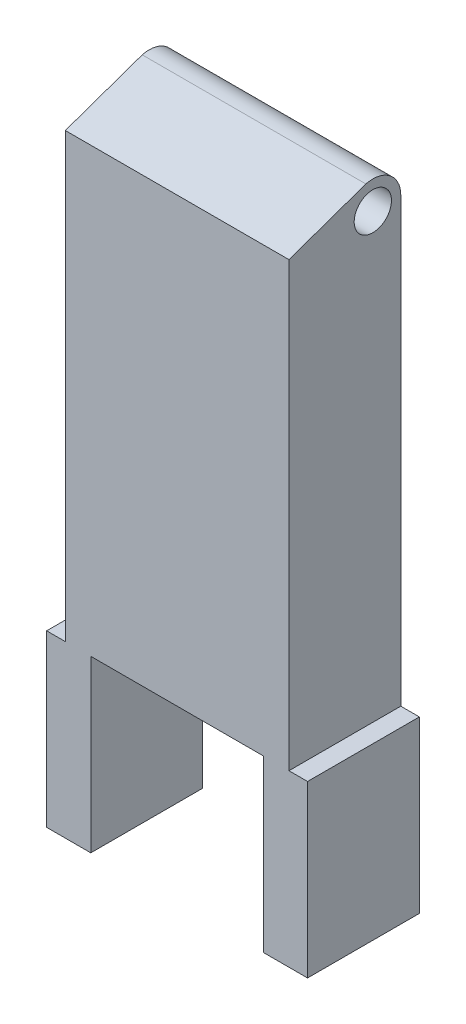
ISO-10303-21;
HEADER;
FILE_DESCRIPTION(('STEP AP214'),'2;1');
FILE_NAME('part.step','',(''),(''),'','','');
FILE_SCHEMA(('AUTOMOTIVE_DESIGN { 1 0 10303 214 1 1 1 1 }'));
ENDSEC;
DATA;
#1=APPLICATION_CONTEXT('core data for automotive mechanical design processes');
#2=APPLICATION_PROTOCOL_DEFINITION('international standard','automotive_design',2000,#1);
#3=PRODUCT_CONTEXT('',#1,'mechanical');
#4=PRODUCT('Part','Part','',(#3));
#5=PRODUCT_RELATED_PRODUCT_CATEGORY('part','',(#4));
#6=PRODUCT_DEFINITION_FORMATION('','',#4);
#7=PRODUCT_DEFINITION_CONTEXT('part definition',#1,'design');
#8=PRODUCT_DEFINITION('design','',#6,#7);
#9=PRODUCT_DEFINITION_SHAPE('','',#8);
#10=(LENGTH_UNIT() NAMED_UNIT(*) SI_UNIT(.MILLI.,.METRE.));
#11=(NAMED_UNIT(*) PLANE_ANGLE_UNIT() SI_UNIT($,.RADIAN.));
#12=(NAMED_UNIT(*) SI_UNIT($,.STERADIAN.) SOLID_ANGLE_UNIT());
#13=UNCERTAINTY_MEASURE_WITH_UNIT(LENGTH_MEASURE(1.E-05),#10,'distance_accuracy_value','');
#14=(GEOMETRIC_REPRESENTATION_CONTEXT(3) GLOBAL_UNCERTAINTY_ASSIGNED_CONTEXT((#13)) GLOBAL_UNIT_ASSIGNED_CONTEXT((#10,
#11,#12)) REPRESENTATION_CONTEXT('',''));
#15=CARTESIAN_POINT('',(0.,0.,0.));
#16=DIRECTION('',(0.,0.,1.));
#17=DIRECTION('',(1.,0.,0.));
#18=AXIS2_PLACEMENT_3D('',#15,#16,#17);
#19=CARTESIAN_POINT('',(-11.9943953349325,44.7749698089172,12.));
#20=DIRECTION('',(1.,0.,0.));
#21=DIRECTION('',(0.,1.,0.));
#22=AXIS2_PLACEMENT_3D('',#19,#20,#21);
#23=PLANE('',#22);
#24=CARTESIAN_POINT('',(-11.9943953349325,44.7749698089172,3.));
#25=DIRECTION('',(1.,0.,0.));
#26=DIRECTION('',(0.,1.,0.));
#27=AXIS2_PLACEMENT_3D('',#24,#25,#26);
#28=CIRCLE('',#27,2.);
#29=CARTESIAN_POINT('',(-11.9943953349325,46.7749698089172,3.));
#30=VERTEX_POINT('',#29);
#31=EDGE_CURVE('E251',#30,#30,#28,.T.);
#32=ORIENTED_EDGE('',*,*,#31,.T.);
#33=EDGE_LOOP('',(#32));
#34=FACE_BOUND('',#33,.T.);
#35=DIRECTION('',(0.,-1.,0.));
#36=VECTOR('',#35,1.);
#37=CARTESIAN_POINT('',(-11.9943953349325,44.7749698089172,0.));
#38=LINE('',#37,#36);
#39=CARTESIAN_POINT('',(-11.9943953349325,44.7749698089172,0.));
#40=VERTEX_POINT('',#39);
#41=CARTESIAN_POINT('',(-11.9943953349325,-2.72503019108281,0.));
#42=VERTEX_POINT('',#41);
#43=EDGE_CURVE('E158',#40,#42,#38,.T.);
#44=ORIENTED_EDGE('',*,*,#43,.T.);
#45=DIRECTION('',(0.,0.,-1.));
#46=VECTOR('',#45,1.);
#47=CARTESIAN_POINT('',(-11.9943953349325,-2.72503019108281,12.));
#48=LINE('',#47,#46);
#49=CARTESIAN_POINT('',(-11.9943953349325,-2.72503019108281,12.));
#50=VERTEX_POINT('',#49);
#51=EDGE_CURVE('E11',#50,#42,#48,.T.);
#52=ORIENTED_EDGE('',*,*,#51,.F.);
#53=DIRECTION('',(0.,-1.,0.));
#54=VECTOR('',#53,1.);
#55=CARTESIAN_POINT('',(-11.9943953349325,44.7749698089172,12.));
#56=LINE('',#55,#54);
#57=CARTESIAN_POINT('',(-11.9943953349325,44.7749698089172,12.));
#58=VERTEX_POINT('',#57);
#59=EDGE_CURVE('E104',#58,#50,#56,.T.);
#60=ORIENTED_EDGE('',*,*,#59,.F.);
#61=DIRECTION('',(0.,-0.332073704616126,0.943253441394476));
#62=VECTOR('',#61,1.);
#63=CARTESIAN_POINT('',(-11.9943953349325,44.7749698089172,12.));
#64=LINE('',#63,#62);
#65=CARTESIAN_POINT('',(-11.9943953349325,47.6805618627776,3.74668254067112));
#66=VERTEX_POINT('',#65);
#67=EDGE_CURVE('E259',#66,#58,#64,.T.);
#68=ORIENTED_EDGE('',*,*,#67,.F.);
#69=CARTESIAN_POINT('',(-11.9943953349325,44.7749698089172,3.));
#70=DIRECTION('',(1.,0.,0.));
#71=DIRECTION('',(0.,1.,0.));
#72=AXIS2_PLACEMENT_3D('',#69,#70,#71);
#73=CIRCLE('',#72,3.);
#74=EDGE_CURVE('E253',#40,#66,#73,.T.);
#75=ORIENTED_EDGE('',*,*,#74,.F.);
#76=EDGE_LOOP('',(#44,#52,#60,#68,#75));
#77=FACE_BOUND('',#76,.T.);
#78=ADVANCED_FACE('F33',(#34,#77),#23,.F.);
#79=CARTESIAN_POINT('',(-11.9943953349325,-2.72503019108281,12.));
#80=DIRECTION('',(0.,-1.,0.));
#81=DIRECTION('',(0.,0.,-1.));
#82=AXIS2_PLACEMENT_3D('',#79,#80,#81);
#83=PLANE('',#82);
#84=DIRECTION('',(-1.,0.,0.));
#85=VECTOR('',#84,1.);
#86=CARTESIAN_POINT('',(-11.9943953349325,-2.72503019108281,0.));
#87=LINE('',#86,#85);
#88=CARTESIAN_POINT('',(-13.9997950624707,-2.72503019108281,0.));
#89=VERTEX_POINT('',#88);
#90=EDGE_CURVE('E161',#42,#89,#87,.T.);
#91=ORIENTED_EDGE('',*,*,#90,.T.);
#92=DIRECTION('',(0.,0.,-1.));
#93=VECTOR('',#92,1.);
#94=CARTESIAN_POINT('',(-13.9997950624707,-2.72503019108281,12.));
#95=LINE('',#94,#93);
#96=CARTESIAN_POINT('',(-13.9997950624707,-2.72503019108281,12.));
#97=VERTEX_POINT('',#96);
#98=EDGE_CURVE('E41',#97,#89,#95,.T.);
#99=ORIENTED_EDGE('',*,*,#98,.F.);
#100=DIRECTION('',(-1.,0.,0.));
#101=VECTOR('',#100,1.);
#102=CARTESIAN_POINT('',(-11.9943953349325,-2.72503019108281,12.));
#103=LINE('',#102,#101);
#104=EDGE_CURVE('E265',#50,#97,#103,.T.);
#105=ORIENTED_EDGE('',*,*,#104,.F.);
#106=ORIENTED_EDGE('',*,*,#51,.T.);
#107=EDGE_LOOP('',(#91,#99,#105,#106));
#108=FACE_BOUND('',#107,.T.);
#109=ADVANCED_FACE('F266',(#108),#83,.F.);
#110=CARTESIAN_POINT('',(-13.9997950624707,-20.9931901910828,12.));
#111=DIRECTION('',(1.,0.,0.));
#112=DIRECTION('',(0.,0.,-1.));
#113=AXIS2_PLACEMENT_3D('',#110,#111,#112);
#114=PLANE('',#113);
#115=DIRECTION('',(0.,-1.,0.));
#116=VECTOR('',#115,1.);
#117=CARTESIAN_POINT('',(-13.9997950624707,-20.9931901910828,0.));
#118=LINE('',#117,#116);
#119=CARTESIAN_POINT('',(-13.9997950624707,-20.9931901910828,0.));
#120=VERTEX_POINT('',#119);
#121=EDGE_CURVE('E163',#89,#120,#118,.T.);
#122=ORIENTED_EDGE('',*,*,#121,.T.);
#123=DIRECTION('',(0.,0.,-1.));
#124=VECTOR('',#123,1.);
#125=CARTESIAN_POINT('',(-13.9997950624707,-20.9931901910828,12.));
#126=LINE('',#125,#124);
#127=CARTESIAN_POINT('',(-13.9997950624707,-20.9931901910828,12.));
#128=VERTEX_POINT('',#127);
#129=EDGE_CURVE('E193',#128,#120,#126,.T.);
#130=ORIENTED_EDGE('',*,*,#129,.F.);
#131=DIRECTION('',(0.,-1.,0.));
#132=VECTOR('',#131,1.);
#133=CARTESIAN_POINT('',(-13.9997950624707,-20.9931901910828,12.));
#134=LINE('',#133,#132);
#135=EDGE_CURVE('E202',#97,#128,#134,.T.);
#136=ORIENTED_EDGE('',*,*,#135,.F.);
#137=ORIENTED_EDGE('',*,*,#98,.T.);
#138=EDGE_LOOP('',(#122,#130,#136,#137));
#139=FACE_BOUND('',#138,.T.);
#140=ADVANCED_FACE('F200',(#139),#114,.F.);
#141=CARTESIAN_POINT('',(-9.26108431245108,-20.9931901910828,12.));
#142=DIRECTION('',(0.,1.,0.));
#143=DIRECTION('',(0.,0.,1.));
#144=AXIS2_PLACEMENT_3D('',#141,#142,#143);
#145=PLANE('',#144);
#146=DIRECTION('',(1.,0.,0.));
#147=VECTOR('',#146,1.);
#148=CARTESIAN_POINT('',(-9.26108431245108,-20.9931901910828,0.));
#149=LINE('',#148,#147);
#150=CARTESIAN_POINT('',(-9.26108431245108,-20.9931901910828,0.));
#151=VERTEX_POINT('',#150);
#152=EDGE_CURVE('E165',#120,#151,#149,.T.);
#153=ORIENTED_EDGE('',*,*,#152,.T.);
#154=DIRECTION('',(0.,0.,-1.));
#155=VECTOR('',#154,1.);
#156=CARTESIAN_POINT('',(-9.26108431245108,-20.9931901910828,12.));
#157=LINE('',#156,#155);
#158=CARTESIAN_POINT('',(-9.26108431245108,-20.9931901910828,12.));
#159=VERTEX_POINT('',#158);
#160=EDGE_CURVE('E190',#159,#151,#157,.T.);
#161=ORIENTED_EDGE('',*,*,#160,.F.);
#162=DIRECTION('',(1.,0.,0.));
#163=VECTOR('',#162,1.);
#164=CARTESIAN_POINT('',(-9.26108431245108,-20.9931901910828,12.));
#165=LINE('',#164,#163);
#166=EDGE_CURVE('E223',#128,#159,#165,.T.);
#167=ORIENTED_EDGE('',*,*,#166,.F.);
#168=ORIENTED_EDGE('',*,*,#129,.T.);
#169=EDGE_LOOP('',(#153,#161,#167,#168));
#170=FACE_BOUND('',#169,.T.);
#171=ADVANCED_FACE('F214',(#170),#145,.F.);
#172=CARTESIAN_POINT('',(-9.26108431245108,-20.9931901910828,12.));
#173=DIRECTION('',(-1.,0.,0.));
#174=DIRECTION('',(0.,0.,1.));
#175=AXIS2_PLACEMENT_3D('',#172,#173,#174);
#176=PLANE('',#175);
#177=DIRECTION('',(0.,1.,0.));
#178=VECTOR('',#177,1.);
#179=CARTESIAN_POINT('',(-9.26108431245108,-20.9931901910828,0.));
#180=LINE('',#179,#178);
#181=CARTESIAN_POINT('',(-9.26108431245108,-2.72503019108281,0.));
#182=VERTEX_POINT('',#181);
#183=EDGE_CURVE('E167',#151,#182,#180,.T.);
#184=ORIENTED_EDGE('',*,*,#183,.T.);
#185=DIRECTION('',(0.,0.,-1.));
#186=VECTOR('',#185,1.);
#187=CARTESIAN_POINT('',(-9.26108431245108,-2.72503019108281,12.));
#188=LINE('',#187,#186);
#189=CARTESIAN_POINT('',(-9.26108431245108,-2.72503019108281,12.));
#190=VERTEX_POINT('',#189);
#191=EDGE_CURVE('E187',#190,#182,#188,.T.);
#192=ORIENTED_EDGE('',*,*,#191,.F.);
#193=DIRECTION('',(0.,1.,0.));
#194=VECTOR('',#193,1.);
#195=CARTESIAN_POINT('',(-9.26108431245108,-20.9931901910828,12.));
#196=LINE('',#195,#194);
#197=EDGE_CURVE('E220',#159,#190,#196,.T.);
#198=ORIENTED_EDGE('',*,*,#197,.F.);
#199=ORIENTED_EDGE('',*,*,#160,.T.);
#200=EDGE_LOOP('',(#184,#192,#198,#199));
#201=FACE_BOUND('',#200,.T.);
#202=ADVANCED_FACE('F218',(#201),#176,.F.);
#203=CARTESIAN_POINT('',(9.26149418750964,-2.72708825757931,12.));
#204=DIRECTION('',(0.000111111230210319,0.999999993827147,0.));
#205=DIRECTION('',(-0.999999993827147,0.000111111230210319,0.));
#206=AXIS2_PLACEMENT_3D('',#203,#204,#205);
#207=PLANE('',#206);
#208=DIRECTION('',(0.999999993827147,-0.000111111230210319,0.));
#209=VECTOR('',#208,1.);
#210=CARTESIAN_POINT('',(9.26149418750964,-2.72708825757931,0.));
#211=LINE('',#210,#209);
#212=CARTESIAN_POINT('',(9.26149418750964,-2.72708825757931,0.));
#213=VERTEX_POINT('',#212);
#214=EDGE_CURVE('E169',#182,#213,#211,.T.);
#215=ORIENTED_EDGE('',*,*,#214,.T.);
#216=DIRECTION('',(0.,0.,-1.));
#217=VECTOR('',#216,1.);
#218=CARTESIAN_POINT('',(9.26149418750964,-2.72708825757931,12.));
#219=LINE('',#218,#217);
#220=CARTESIAN_POINT('',(9.26149418750964,-2.72708825757931,12.));
#221=VERTEX_POINT('',#220);
#222=EDGE_CURVE('E184',#221,#213,#219,.T.);
#223=ORIENTED_EDGE('',*,*,#222,.F.);
#224=DIRECTION('',(0.999999993827147,-0.000111111230210319,0.));
#225=VECTOR('',#224,1.);
#226=CARTESIAN_POINT('',(9.26149418750964,-2.72708825757931,12.));
#227=LINE('',#226,#225);
#228=EDGE_CURVE('E222',#190,#221,#227,.T.);
#229=ORIENTED_EDGE('',*,*,#228,.F.);
#230=ORIENTED_EDGE('',*,*,#191,.T.);
#231=EDGE_LOOP('',(#215,#223,#229,#230));
#232=FACE_BOUND('',#231,.T.);
#233=ADVANCED_FACE('F370',(#232),#207,.F.);
#234=CARTESIAN_POINT('',(9.26149418750964,-20.9931901910828,12.));
#235=DIRECTION('',(1.,0.,0.));
#236=DIRECTION('',(0.,0.,-1.));
#237=AXIS2_PLACEMENT_3D('',#234,#235,#236);
#238=PLANE('',#237);
#239=DIRECTION('',(0.,-1.,0.));
#240=VECTOR('',#239,1.);
#241=CARTESIAN_POINT('',(9.26149418750964,-20.9931901910828,0.));
#242=LINE('',#241,#240);
#243=CARTESIAN_POINT('',(9.26149418750964,-20.9931901910828,0.));
#244=VERTEX_POINT('',#243);
#245=EDGE_CURVE('E171',#213,#244,#242,.T.);
#246=ORIENTED_EDGE('',*,*,#245,.T.);
#247=DIRECTION('',(0.,0.,-1.));
#248=VECTOR('',#247,1.);
#249=CARTESIAN_POINT('',(9.26149418750964,-20.9931901910828,12.));
#250=LINE('',#249,#248);
#251=CARTESIAN_POINT('',(9.26149418750964,-20.9931901910828,12.));
#252=VERTEX_POINT('',#251);
#253=EDGE_CURVE('E181',#252,#244,#250,.T.);
#254=ORIENTED_EDGE('',*,*,#253,.F.);
#255=DIRECTION('',(0.,-1.,0.));
#256=VECTOR('',#255,1.);
#257=CARTESIAN_POINT('',(9.26149418750964,-20.9931901910828,12.));
#258=LINE('',#257,#256);
#259=EDGE_CURVE('E225',#221,#252,#258,.T.);
#260=ORIENTED_EDGE('',*,*,#259,.F.);
#261=ORIENTED_EDGE('',*,*,#222,.T.);
#262=EDGE_LOOP('',(#246,#254,#260,#261));
#263=FACE_BOUND('',#262,.T.);
#264=ADVANCED_FACE('F234',(#263),#238,.F.);
#265=CARTESIAN_POINT('',(9.26149418750964,-20.9931901910828,12.));
#266=DIRECTION('',(0.,1.,0.));
#267=DIRECTION('',(0.,0.,1.));
#268=AXIS2_PLACEMENT_3D('',#265,#266,#267);
#269=PLANE('',#268);
#270=DIRECTION('',(1.,0.,0.));
#271=VECTOR('',#270,1.);
#272=CARTESIAN_POINT('',(9.26149418750964,-20.9931901910828,0.));
#273=LINE('',#272,#271);
#274=CARTESIAN_POINT('',(14.0002049375293,-20.9931901910828,0.));
#275=VERTEX_POINT('',#274);
#276=EDGE_CURVE('E173',#244,#275,#273,.T.);
#277=ORIENTED_EDGE('',*,*,#276,.T.);
#278=DIRECTION('',(0.,0.,-1.));
#279=VECTOR('',#278,1.);
#280=CARTESIAN_POINT('',(14.0002049375293,-20.9931901910828,12.));
#281=LINE('',#280,#279);
#282=CARTESIAN_POINT('',(14.0002049375293,-20.9931901910828,12.));
#283=VERTEX_POINT('',#282);
#284=EDGE_CURVE('E147',#283,#275,#281,.T.);
#285=ORIENTED_EDGE('',*,*,#284,.F.);
#286=DIRECTION('',(1.,0.,0.));
#287=VECTOR('',#286,1.);
#288=CARTESIAN_POINT('',(9.26149418750964,-20.9931901910828,12.));
#289=LINE('',#288,#287);
#290=EDGE_CURVE('E138',#252,#283,#289,.T.);
#291=ORIENTED_EDGE('',*,*,#290,.F.);
#292=ORIENTED_EDGE('',*,*,#253,.T.);
#293=EDGE_LOOP('',(#277,#285,#291,#292));
#294=FACE_BOUND('',#293,.T.);
#295=ADVANCED_FACE('F238',(#294),#269,.F.);
#296=CARTESIAN_POINT('',(14.0002049375293,-20.9931901910828,12.));
#297=DIRECTION('',(-1.,0.,0.));
#298=DIRECTION('',(0.,0.,1.));
#299=AXIS2_PLACEMENT_3D('',#296,#297,#298);
#300=PLANE('',#299);
#301=DIRECTION('',(0.,1.,0.));
#302=VECTOR('',#301,1.);
#303=CARTESIAN_POINT('',(14.0002049375293,-20.9931901910828,0.));
#304=LINE('',#303,#302);
#305=CARTESIAN_POINT('',(14.0002049375293,-2.72708825757931,0.));
#306=VERTEX_POINT('',#305);
#307=EDGE_CURVE('E146',#275,#306,#304,.T.);
#308=ORIENTED_EDGE('',*,*,#307,.T.);
#309=DIRECTION('',(0.,0.,-1.));
#310=VECTOR('',#309,1.);
#311=CARTESIAN_POINT('',(14.0002049375293,-2.72708825757931,12.));
#312=LINE('',#311,#310);
#313=CARTESIAN_POINT('',(14.0002049375293,-2.72708825757931,12.));
#314=VERTEX_POINT('',#313);
#315=EDGE_CURVE('E143',#314,#306,#312,.T.);
#316=ORIENTED_EDGE('',*,*,#315,.F.);
#317=DIRECTION('',(0.,1.,0.));
#318=VECTOR('',#317,1.);
#319=CARTESIAN_POINT('',(14.0002049375293,-20.9931901910828,12.));
#320=LINE('',#319,#318);
#321=EDGE_CURVE('E132',#283,#314,#320,.T.);
#322=ORIENTED_EDGE('',*,*,#321,.F.);
#323=ORIENTED_EDGE('',*,*,#284,.T.);
#324=EDGE_LOOP('',(#308,#316,#322,#323));
#325=FACE_BOUND('',#324,.T.);
#326=ADVANCED_FACE('F144',(#325),#300,.F.);
#327=CARTESIAN_POINT('',(14.0002049375293,-2.72708825757931,12.));
#328=DIRECTION('',(0.,-1.,0.));
#329=DIRECTION('',(0.,0.,-1.));
#330=AXIS2_PLACEMENT_3D('',#327,#328,#329);
#331=PLANE('',#330);
#332=DIRECTION('',(-1.,0.,0.));
#333=VECTOR('',#332,1.);
#334=CARTESIAN_POINT('',(14.0002049375293,-2.72708825757931,0.));
#335=LINE('',#334,#333);
#336=CARTESIAN_POINT('',(12.0056046650675,-2.72708825757931,0.));
#337=VERTEX_POINT('',#336);
#338=EDGE_CURVE('E88',#306,#337,#335,.T.);
#339=ORIENTED_EDGE('',*,*,#338,.T.);
#340=DIRECTION('',(0.,0.,-1.));
#341=VECTOR('',#340,1.);
#342=CARTESIAN_POINT('',(12.0056046650675,-2.72708825757931,12.));
#343=LINE('',#342,#341);
#344=CARTESIAN_POINT('',(12.0056046650675,-2.72708825757931,12.));
#345=VERTEX_POINT('',#344);
#346=EDGE_CURVE('E148',#345,#337,#343,.T.);
#347=ORIENTED_EDGE('',*,*,#346,.F.);
#348=DIRECTION('',(-1.,0.,0.));
#349=VECTOR('',#348,1.);
#350=CARTESIAN_POINT('',(14.0002049375293,-2.72708825757931,12.));
#351=LINE('',#350,#349);
#352=EDGE_CURVE('E136',#314,#345,#351,.T.);
#353=ORIENTED_EDGE('',*,*,#352,.F.);
#354=ORIENTED_EDGE('',*,*,#315,.T.);
#355=EDGE_LOOP('',(#339,#347,#353,#354));
#356=FACE_BOUND('',#355,.T.);
#357=ADVANCED_FACE('F150',(#356),#331,.F.);
#358=CARTESIAN_POINT('',(12.0056046650675,44.7749698089172,12.));
#359=DIRECTION('',(-1.,0.,0.));
#360=DIRECTION('',(0.,-1.,0.));
#361=AXIS2_PLACEMENT_3D('',#358,#359,#360);
#362=PLANE('',#361);
#363=CARTESIAN_POINT('',(12.0056046650675,44.7749698089172,3.));
#364=DIRECTION('',(1.,0.,0.));
#365=DIRECTION('',(0.,1.,0.));
#366=AXIS2_PLACEMENT_3D('',#363,#364,#365);
#367=CIRCLE('',#366,2.);
#368=CARTESIAN_POINT('',(12.0056046650675,46.7749698089172,3.));
#369=VERTEX_POINT('',#368);
#370=EDGE_CURVE('E256',#369,#369,#367,.T.);
#371=ORIENTED_EDGE('',*,*,#370,.F.);
#372=EDGE_LOOP('',(#371));
#373=FACE_BOUND('',#372,.T.);
#374=DIRECTION('',(0.,1.,0.));
#375=VECTOR('',#374,1.);
#376=CARTESIAN_POINT('',(12.0056046650675,44.7749698089172,0.));
#377=LINE('',#376,#375);
#378=CARTESIAN_POINT('',(12.0056046650675,44.7749698089172,0.));
#379=VERTEX_POINT('',#378);
#380=EDGE_CURVE('E95',#337,#379,#377,.T.);
#381=ORIENTED_EDGE('',*,*,#380,.T.);
#382=CARTESIAN_POINT('',(12.0056046650675,44.7749698089172,3.));
#383=DIRECTION('',(1.,0.,0.));
#384=DIRECTION('',(0.,1.,0.));
#385=AXIS2_PLACEMENT_3D('',#382,#383,#384);
#386=CIRCLE('',#385,3.);
#387=CARTESIAN_POINT('',(12.0056046650675,47.6805618627776,3.74668254067112));
#388=VERTEX_POINT('',#387);
#389=EDGE_CURVE('E245',#379,#388,#386,.T.);
#390=ORIENTED_EDGE('',*,*,#389,.T.);
#391=DIRECTION('',(0.,-0.332073704616126,0.943253441394476));
#392=VECTOR('',#391,1.);
#393=CARTESIAN_POINT('',(12.0056046650675,44.7749698089172,12.));
#394=LINE('',#393,#392);
#395=CARTESIAN_POINT('',(12.0056046650675,44.7749698089172,12.));
#396=VERTEX_POINT('',#395);
#397=EDGE_CURVE('E250',#388,#396,#394,.T.);
#398=ORIENTED_EDGE('',*,*,#397,.T.);
#399=DIRECTION('',(0.,1.,0.));
#400=VECTOR('',#399,1.);
#401=CARTESIAN_POINT('',(12.0056046650675,44.7749698089172,12.));
#402=LINE('',#401,#400);
#403=EDGE_CURVE('E49',#345,#396,#402,.T.);
#404=ORIENTED_EDGE('',*,*,#403,.F.);
#405=ORIENTED_EDGE('',*,*,#346,.T.);
#406=EDGE_LOOP('',(#381,#390,#398,#404,#405));
#407=FACE_BOUND('',#406,.T.);
#408=ADVANCED_FACE('F276',(#373,#407),#362,.F.);
#409=CARTESIAN_POINT('',(0.,0.,12.));
#410=DIRECTION('',(0.,0.,-1.));
#411=DIRECTION('',(-1.,0.,0.));
#412=AXIS2_PLACEMENT_3D('',#409,#410,#411);
#413=PLANE('',#412);
#414=DIRECTION('',(-1.,0.,0.));
#415=VECTOR('',#414,1.);
#416=CARTESIAN_POINT('',(-11.9943953349325,44.7749698089172,12.));
#417=LINE('',#416,#415);
#418=EDGE_CURVE('E178',#396,#58,#417,.T.);
#419=ORIENTED_EDGE('',*,*,#418,.T.);
#420=ORIENTED_EDGE('',*,*,#59,.T.);
#421=ORIENTED_EDGE('',*,*,#104,.T.);
#422=ORIENTED_EDGE('',*,*,#135,.T.);
#423=ORIENTED_EDGE('',*,*,#166,.T.);
#424=ORIENTED_EDGE('',*,*,#197,.T.);
#425=ORIENTED_EDGE('',*,*,#228,.T.);
#426=ORIENTED_EDGE('',*,*,#259,.T.);
#427=ORIENTED_EDGE('',*,*,#290,.T.);
#428=ORIENTED_EDGE('',*,*,#321,.T.);
#429=ORIENTED_EDGE('',*,*,#352,.T.);
#430=ORIENTED_EDGE('',*,*,#403,.T.);
#431=EDGE_LOOP('',(#419,#420,#421,#422,#423,#424,#425,#426,#427,#428,#429,#430));
#432=FACE_BOUND('',#431,.T.);
#433=ADVANCED_FACE('F134',(#432),#413,.F.);
#434=CARTESIAN_POINT('',(0.,0.,0.));
#435=DIRECTION('',(0.,0.,-1.));
#436=DIRECTION('',(-1.,0.,0.));
#437=AXIS2_PLACEMENT_3D('',#434,#435,#436);
#438=PLANE('',#437);
#439=DIRECTION('',(-1.,0.,0.));
#440=VECTOR('',#439,1.);
#441=CARTESIAN_POINT('',(-11.9943953349325,44.7749698089172,0.));
#442=LINE('',#441,#440);
#443=EDGE_CURVE('E155',#379,#40,#442,.T.);
#444=ORIENTED_EDGE('',*,*,#443,.F.);
#445=ORIENTED_EDGE('',*,*,#380,.F.);
#446=ORIENTED_EDGE('',*,*,#338,.F.);
#447=ORIENTED_EDGE('',*,*,#307,.F.);
#448=ORIENTED_EDGE('',*,*,#276,.F.);
#449=ORIENTED_EDGE('',*,*,#245,.F.);
#450=ORIENTED_EDGE('',*,*,#214,.F.);
#451=ORIENTED_EDGE('',*,*,#183,.F.);
#452=ORIENTED_EDGE('',*,*,#152,.F.);
#453=ORIENTED_EDGE('',*,*,#121,.F.);
#454=ORIENTED_EDGE('',*,*,#90,.F.);
#455=ORIENTED_EDGE('',*,*,#43,.F.);
#456=EDGE_LOOP('',(#444,#445,#446,#447,#448,#449,#450,#451,#452,#453,#454,#455));
#457=FACE_BOUND('',#456,.T.);
#458=ADVANCED_FACE('F208',(#457),#438,.T.);
#459=CARTESIAN_POINT('',(-11.9943953349325,44.7749698089172,12.));
#460=DIRECTION('',(0.,0.943253441394476,0.332073704616126));
#461=DIRECTION('',(0.,-0.332073704616126,0.943253441394476));
#462=AXIS2_PLACEMENT_3D('',#459,#460,#461);
#463=PLANE('',#462);
#464=ORIENTED_EDGE('',*,*,#397,.F.);
#465=DIRECTION('',(1.,0.,0.));
#466=VECTOR('',#465,1.);
#467=CARTESIAN_POINT('',(-11.9943953349325,47.6805618627776,3.74668254067112));
#468=LINE('',#467,#466);
#469=EDGE_CURVE('E159',#66,#388,#468,.T.);
#470=ORIENTED_EDGE('',*,*,#469,.F.);
#471=ORIENTED_EDGE('',*,*,#67,.T.);
#472=ORIENTED_EDGE('',*,*,#418,.F.);
#473=EDGE_LOOP('',(#464,#470,#471,#472));
#474=FACE_BOUND('',#473,.T.);
#475=ADVANCED_FACE('F297',(#474),#463,.T.);
#476=CARTESIAN_POINT('',(-11.9943953349325,44.7749698089172,3.));
#477=DIRECTION('',(1.,0.,0.));
#478=DIRECTION('',(0.,1.,0.));
#479=AXIS2_PLACEMENT_3D('',#476,#477,#478);
#480=CYLINDRICAL_SURFACE('',#479,3.);
#481=ORIENTED_EDGE('',*,*,#389,.F.);
#482=ORIENTED_EDGE('',*,*,#443,.T.);
#483=ORIENTED_EDGE('',*,*,#74,.T.);
#484=ORIENTED_EDGE('',*,*,#469,.T.);
#485=EDGE_LOOP('',(#481,#482,#483,#484));
#486=FACE_BOUND('',#485,.T.);
#487=ADVANCED_FACE('F246',(#486),#480,.T.);
#488=CARTESIAN_POINT('',(-13.9997950624707,44.7749698089172,3.));
#489=DIRECTION('',(1.,0.,0.));
#490=DIRECTION('',(0.,1.,0.));
#491=AXIS2_PLACEMENT_3D('',#488,#489,#490);
#492=CYLINDRICAL_SURFACE('',#491,2.);
#493=ORIENTED_EDGE('',*,*,#370,.T.);
#494=EDGE_LOOP('',(#493));
#495=FACE_BOUND('',#494,.T.);
#496=ORIENTED_EDGE('',*,*,#31,.F.);
#497=EDGE_LOOP('',(#496));
#498=FACE_BOUND('',#497,.T.);
#499=ADVANCED_FACE('F273',(#495,#498),#492,.F.);
#500=CLOSED_SHELL('',(#78,#109,#140,#171,#202,#233,#264,#295,#326,#357,#408,#433,#458,#475,#487,#499));
#501=MANIFOLD_SOLID_BREP('B2',#500);
#502=ADVANCED_BREP_SHAPE_REPRESENTATION('',(#18,#501),#14);
#503=SHAPE_DEFINITION_REPRESENTATION(#9,#502);
ENDSEC;
END-ISO-10303-21;
